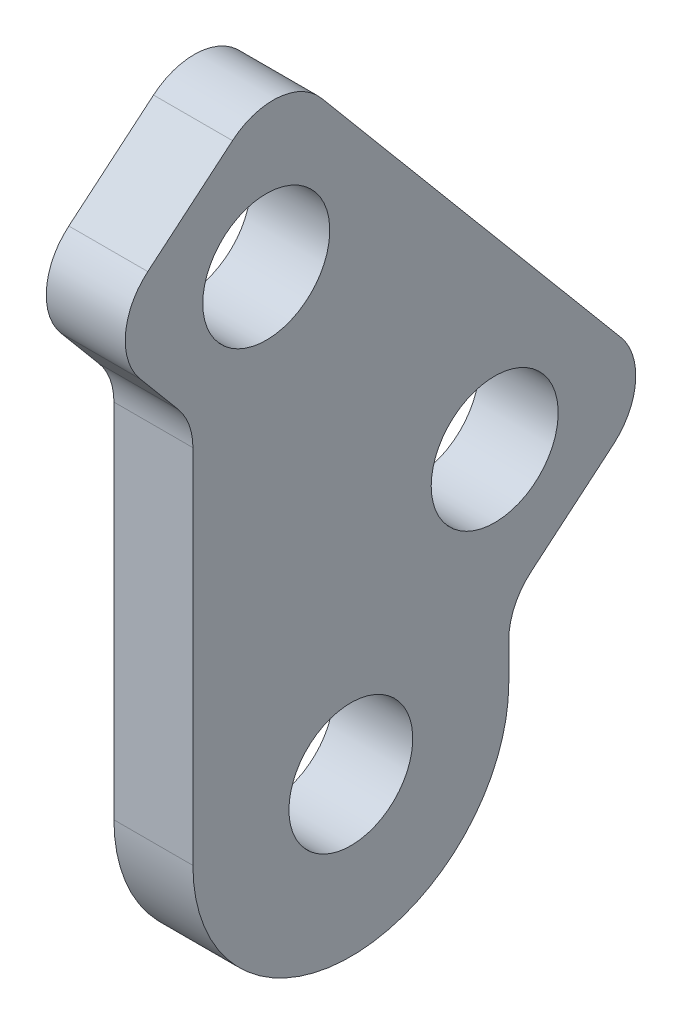
ISO-10303-21;
HEADER;
FILE_DESCRIPTION(('STEP AP214'),'2;1');
FILE_NAME('part.step','',(''),(''),'','','');
FILE_SCHEMA(('AUTOMOTIVE_DESIGN { 1 0 10303 214 1 1 1 1 }'));
ENDSEC;
DATA;
#1=APPLICATION_CONTEXT('core data for automotive mechanical design processes');
#2=APPLICATION_PROTOCOL_DEFINITION('international standard','automotive_design',2000,#1);
#3=PRODUCT_CONTEXT('',#1,'mechanical');
#4=PRODUCT('Part','Part','',(#3));
#5=PRODUCT_RELATED_PRODUCT_CATEGORY('part','',(#4));
#6=PRODUCT_DEFINITION_FORMATION('','',#4);
#7=PRODUCT_DEFINITION_CONTEXT('part definition',#1,'design');
#8=PRODUCT_DEFINITION('design','',#6,#7);
#9=PRODUCT_DEFINITION_SHAPE('','',#8);
#10=(LENGTH_UNIT() NAMED_UNIT(*) SI_UNIT(.MILLI.,.METRE.));
#11=(NAMED_UNIT(*) PLANE_ANGLE_UNIT() SI_UNIT($,.RADIAN.));
#12=(NAMED_UNIT(*) SI_UNIT($,.STERADIAN.) SOLID_ANGLE_UNIT());
#13=UNCERTAINTY_MEASURE_WITH_UNIT(LENGTH_MEASURE(1.E-05),#10,'distance_accuracy_value','');
#14=(GEOMETRIC_REPRESENTATION_CONTEXT(3) GLOBAL_UNCERTAINTY_ASSIGNED_CONTEXT((#13)) GLOBAL_UNIT_ASSIGNED_CONTEXT((#10,
#11,#12)) REPRESENTATION_CONTEXT('',''));
#15=CARTESIAN_POINT('',(0.,0.,0.));
#16=DIRECTION('',(0.,0.,1.));
#17=DIRECTION('',(1.,0.,0.));
#18=AXIS2_PLACEMENT_3D('',#15,#16,#17);
#19=CARTESIAN_POINT('',(1.5875,9.52500000000001,-176.47164647412));
#20=DIRECTION('',(-1.,0.,0.));
#21=DIRECTION('',(0.,0.,1.));
#22=AXIS2_PLACEMENT_3D('',#19,#20,#21);
#23=CYLINDRICAL_SURFACE('',#22,6.34999999999999);
#24=CARTESIAN_POINT('',(-1.5875,9.52500000000001,-176.47164647412));
#25=DIRECTION('',(-1.,0.,0.));
#26=DIRECTION('',(0.,0.,1.));
#27=AXIS2_PLACEMENT_3D('',#24,#25,#26);
#28=CIRCLE('',#27,6.34999999999999);
#29=CARTESIAN_POINT('',(-1.5875,9.52500000000001,-182.82164647412));
#30=VERTEX_POINT('',#29);
#31=CARTESIAN_POINT('',(-1.5875,9.52500000000001,-170.12164647412));
#32=VERTEX_POINT('',#31);
#33=EDGE_CURVE('E167',#30,#32,#28,.T.);
#34=ORIENTED_EDGE('',*,*,#33,.F.);
#35=DIRECTION('',(-1.,0.,0.));
#36=VECTOR('',#35,1.);
#37=CARTESIAN_POINT('',(1.5875,9.52500000000001,-182.82164647412));
#38=LINE('',#37,#36);
#39=CARTESIAN_POINT('',(1.5875,9.52500000000001,-182.82164647412));
#40=VERTEX_POINT('',#39);
#41=EDGE_CURVE('E136',#40,#30,#38,.T.);
#42=ORIENTED_EDGE('',*,*,#41,.F.);
#43=CARTESIAN_POINT('',(1.5875,9.52500000000001,-176.47164647412));
#44=DIRECTION('',(-1.,0.,0.));
#45=DIRECTION('',(0.,0.,1.));
#46=AXIS2_PLACEMENT_3D('',#43,#44,#45);
#47=CIRCLE('',#46,6.34999999999999);
#48=CARTESIAN_POINT('',(1.5875,9.52500000000001,-170.12164647412));
#49=VERTEX_POINT('',#48);
#50=EDGE_CURVE('E143',#40,#49,#47,.T.);
#51=ORIENTED_EDGE('',*,*,#50,.T.);
#52=DIRECTION('',(-1.,0.,0.));
#53=VECTOR('',#52,1.);
#54=CARTESIAN_POINT('',(1.5875,9.52500000000001,-170.12164647412));
#55=LINE('',#54,#53);
#56=EDGE_CURVE('E125',#49,#32,#55,.T.);
#57=ORIENTED_EDGE('',*,*,#56,.T.);
#58=EDGE_LOOP('',(#34,#42,#51,#57));
#59=FACE_BOUND('',#58,.T.);
#60=ADVANCED_FACE('F37',(#59),#23,.T.);
#61=CARTESIAN_POINT('',(1.5875,82.55,-182.82164647412));
#62=DIRECTION('',(0.,0.,-1.));
#63=DIRECTION('',(-1.,0.,0.));
#64=AXIS2_PLACEMENT_3D('',#61,#62,#63);
#65=PLANE('',#64);
#66=DIRECTION('',(0.,-1.,0.));
#67=VECTOR('',#66,1.);
#68=CARTESIAN_POINT('',(-1.5875,82.55,-182.82164647412));
#69=LINE('',#68,#67);
#70=CARTESIAN_POINT('',(-1.5875,11.0180825675104,-182.82164647412));
#71=VERTEX_POINT('',#70);
#72=EDGE_CURVE('E148',#71,#30,#69,.T.);
#73=ORIENTED_EDGE('',*,*,#72,.F.);
#74=DIRECTION('',(-1.,0.,0.));
#75=VECTOR('',#74,1.);
#76=CARTESIAN_POINT('',(1.5875,11.0180825675104,-182.82164647412));
#77=LINE('',#76,#75);
#78=CARTESIAN_POINT('',(1.5875,11.0180825675104,-182.82164647412));
#79=VERTEX_POINT('',#78);
#80=EDGE_CURVE('E204',#71,#79,#77,.F.);
#81=ORIENTED_EDGE('',*,*,#80,.T.);
#82=DIRECTION('',(0.,-1.,0.));
#83=VECTOR('',#82,1.);
#84=CARTESIAN_POINT('',(1.5875,82.55,-182.82164647412));
#85=LINE('',#84,#83);
#86=EDGE_CURVE('E137',#79,#40,#85,.T.);
#87=ORIENTED_EDGE('',*,*,#86,.T.);
#88=ORIENTED_EDGE('',*,*,#41,.T.);
#89=EDGE_LOOP('',(#73,#81,#87,#88));
#90=FACE_BOUND('',#89,.T.);
#91=ADVANCED_FACE('F243',(#90),#65,.T.);
#92=CARTESIAN_POINT('',(1.5875,12.2182173446487,-182.840372886147));
#93=DIRECTION('',(0.,-0.766044443118973,-0.642787609686545));
#94=DIRECTION('',(0.,0.642787609686545,-0.766044443118973));
#95=AXIS2_PLACEMENT_3D('',#92,#93,#94);
#96=PLANE('',#95);
#97=DIRECTION('',(0.,-0.642787609686545,0.766044443118973));
#98=VECTOR('',#97,1.);
#99=CARTESIAN_POINT('',(-1.5875,12.2182173446487,-182.840372886147));
#100=LINE('',#99,#98);
#101=CARTESIAN_POINT('',(-1.5875,15.7246917514835,-187.019226357832));
#102=VERTEX_POINT('',#101);
#103=CARTESIAN_POINT('',(-1.5875,12.9638354530325,-183.728965945517));
#104=VERTEX_POINT('',#103);
#105=EDGE_CURVE('E150',#102,#104,#100,.T.);
#106=ORIENTED_EDGE('',*,*,#105,.F.);
#107=DIRECTION('',(-1.,0.,0.));
#108=VECTOR('',#107,1.);
#109=CARTESIAN_POINT('',(1.5875,15.7246917514835,-187.019226357832));
#110=LINE('',#109,#108);
#111=CARTESIAN_POINT('',(1.5875,15.7246917514835,-187.019226357832));
#112=VERTEX_POINT('',#111);
#113=EDGE_CURVE('E197',#102,#112,#110,.F.);
#114=ORIENTED_EDGE('',*,*,#113,.T.);
#115=DIRECTION('',(0.,-0.642787609686545,0.766044443118973));
#116=VECTOR('',#115,1.);
#117=CARTESIAN_POINT('',(1.5875,12.2182173446487,-182.840372886147));
#118=LINE('',#117,#116);
#119=CARTESIAN_POINT('',(1.5875,12.9638354530325,-183.728965945517));
#120=VERTEX_POINT('',#119);
#121=EDGE_CURVE('E163',#112,#120,#118,.T.);
#122=ORIENTED_EDGE('',*,*,#121,.T.);
#123=DIRECTION('',(-1.,0.,0.));
#124=VECTOR('',#123,1.);
#125=CARTESIAN_POINT('',(-1.5875,12.9638354530325,-183.728965945517));
#126=LINE('',#125,#124);
#127=EDGE_CURVE('E194',#120,#104,#126,.T.);
#128=ORIENTED_EDGE('',*,*,#127,.T.);
#129=EDGE_LOOP('',(#106,#114,#122,#128));
#130=FACE_BOUND('',#129,.T.);
#131=ADVANCED_FACE('F248',(#130),#96,.T.);
#132=CARTESIAN_POINT('',(1.5875,87.6891549354387,-129.949606357207));
#133=DIRECTION('',(0.,0.642787609686544,-0.766044443118974));
#134=DIRECTION('',(0.,0.766044443118974,0.642787609686544));
#135=AXIS2_PLACEMENT_3D('',#132,#133,#134);
#136=PLANE('',#135);
#137=DIRECTION('',(0.,-0.766044443118974,-0.642787609686544));
#138=VECTOR('',#137,1.);
#139=CARTESIAN_POINT('',(1.5875,87.6891549354387,-129.949606357207));
#140=LINE('',#139,#138);
#141=CARTESIAN_POINT('',(1.5875,33.6530526963356,-175.291279816297));
#142=VERTEX_POINT('',#141);
#143=CARTESIAN_POINT('',(1.5875,19.3031251656094,-187.33229871475));
#144=VERTEX_POINT('',#143);
#145=EDGE_CURVE('E160',#142,#144,#140,.T.);
#146=ORIENTED_EDGE('',*,*,#145,.T.);
#147=DIRECTION('',(-1.,0.,0.));
#148=VECTOR('',#147,1.);
#149=CARTESIAN_POINT('',(1.5875,19.3031251656095,-187.33229871475));
#150=LINE('',#149,#148);
#151=CARTESIAN_POINT('',(-1.5875,19.3031251656094,-187.33229871475));
#152=VERTEX_POINT('',#151);
#153=EDGE_CURVE('E185',#144,#152,#150,.T.);
#154=ORIENTED_EDGE('',*,*,#153,.T.);
#155=DIRECTION('',(0.,-0.766044443118974,-0.642787609686544));
#156=VECTOR('',#155,1.);
#157=CARTESIAN_POINT('',(-1.5875,87.6891549354387,-129.949606357207));
#158=LINE('',#157,#156);
#159=CARTESIAN_POINT('',(-1.5875,33.6530526963356,-175.291279816297));
#160=VERTEX_POINT('',#159);
#161=EDGE_CURVE('E177',#160,#152,#158,.T.);
#162=ORIENTED_EDGE('',*,*,#161,.F.);
#163=DIRECTION('',(-1.,0.,0.));
#164=VECTOR('',#163,1.);
#165=CARTESIAN_POINT('',(1.5875,33.6530526963356,-175.291279816297));
#166=LINE('',#165,#164);
#167=EDGE_CURVE('E182',#160,#142,#166,.F.);
#168=ORIENTED_EDGE('',*,*,#167,.T.);
#169=EDGE_LOOP('',(#146,#154,#162,#168));
#170=FACE_BOUND('',#169,.T.);
#171=ADVANCED_FACE('F269',(#170),#136,.T.);
#172=CARTESIAN_POINT('',(1.5875,30.4596506464192,-167.533992930486));
#173=DIRECTION('',(0.,0.766044443118973,0.642787609686545));
#174=DIRECTION('',(0.,-0.642787609686545,0.766044443118973));
#175=AXIS2_PLACEMENT_3D('',#172,#173,#174);
#176=PLANE('',#175);
#177=DIRECTION('',(0.,0.642787609686545,-0.766044443118973));
#178=VECTOR('',#177,1.);
#179=CARTESIAN_POINT('',(-1.5875,30.4596506464192,-167.533992930486));
#180=LINE('',#179,#178);
#181=CARTESIAN_POINT('',(-1.5875,31.1089341281973,-168.307778852507));
#182=VERTEX_POINT('',#181);
#183=CARTESIAN_POINT('',(-1.5875,33.966125053254,-171.712846402171));
#184=VERTEX_POINT('',#183);
#185=EDGE_CURVE('E174',#182,#184,#180,.T.);
#186=ORIENTED_EDGE('',*,*,#185,.F.);
#187=DIRECTION('',(-1.,0.,0.));
#188=VECTOR('',#187,1.);
#189=CARTESIAN_POINT('',(1.5875,31.1089341281973,-168.307778852507));
#190=LINE('',#189,#188);
#191=CARTESIAN_POINT('',(1.5875,31.1089341281973,-168.307778852507));
#192=VERTEX_POINT('',#191);
#193=EDGE_CURVE('E216',#182,#192,#190,.F.);
#194=ORIENTED_EDGE('',*,*,#193,.T.);
#195=DIRECTION('',(0.,0.642787609686545,-0.766044443118973));
#196=VECTOR('',#195,1.);
#197=CARTESIAN_POINT('',(1.5875,30.4596506464192,-167.533992930486));
#198=LINE('',#197,#196);
#199=CARTESIAN_POINT('',(1.5875,33.966125053254,-171.712846402171));
#200=VERTEX_POINT('',#199);
#201=EDGE_CURVE('E157',#192,#200,#198,.T.);
#202=ORIENTED_EDGE('',*,*,#201,.T.);
#203=DIRECTION('',(-1.,0.,0.));
#204=VECTOR('',#203,1.);
#205=CARTESIAN_POINT('',(1.5875,33.966125053254,-171.712846402171));
#206=LINE('',#205,#204);
#207=EDGE_CURVE('E213',#200,#184,#206,.T.);
#208=ORIENTED_EDGE('',*,*,#207,.T.);
#209=EDGE_LOOP('',(#186,#194,#202,#208));
#210=FACE_BOUND('',#209,.T.);
#211=ADVANCED_FACE('F276',(#210),#176,.T.);
#212=CARTESIAN_POINT('',(1.5875,81.5666029531744,-122.653033036499));
#213=DIRECTION('',(0.,-0.642787609686544,0.766044443118974));
#214=DIRECTION('',(0.,-0.766044443118975,-0.642787609686544));
#215=AXIS2_PLACEMENT_3D('',#212,#213,#214);
#216=PLANE('',#215);
#217=DIRECTION('',(0.,0.766044443118974,0.642787609686544));
#218=VECTOR('',#217,1.);
#219=CARTESIAN_POINT('',(-1.5875,81.5666029531744,-122.653033036499));
#220=LINE('',#219,#218);
#221=CARTESIAN_POINT('',(-1.5875,25.7039084869915,-169.527399359643));
#222=VERTEX_POINT('',#221);
#223=CARTESIAN_POINT('',(-1.5875,27.5305007140713,-167.994706495589));
#224=VERTEX_POINT('',#223);
#225=EDGE_CURVE('E171',#222,#224,#220,.T.);
#226=ORIENTED_EDGE('',*,*,#225,.F.);
#227=DIRECTION('',(-1.,0.,0.));
#228=VECTOR('',#227,1.);
#229=CARTESIAN_POINT('',(1.5875,25.7039084869915,-169.527399359643));
#230=LINE('',#229,#228);
#231=CARTESIAN_POINT('',(1.5875,25.7039084869915,-169.527399359643));
#232=VERTEX_POINT('',#231);
#233=EDGE_CURVE('E211',#222,#232,#230,.F.);
#234=ORIENTED_EDGE('',*,*,#233,.T.);
#235=DIRECTION('',(0.,0.766044443118974,0.642787609686544));
#236=VECTOR('',#235,1.);
#237=CARTESIAN_POINT('',(1.5875,81.5666029531744,-122.653033036499));
#238=LINE('',#237,#236);
#239=CARTESIAN_POINT('',(1.5875,27.5305007140713,-167.994706495589));
#240=VERTEX_POINT('',#239);
#241=EDGE_CURVE('E144',#232,#240,#238,.T.);
#242=ORIENTED_EDGE('',*,*,#241,.T.);
#243=DIRECTION('',(-1.,0.,0.));
#244=VECTOR('',#243,1.);
#245=CARTESIAN_POINT('',(1.5875,27.5305007140713,-167.994706495589));
#246=LINE('',#245,#244);
#247=EDGE_CURVE('E208',#240,#224,#246,.T.);
#248=ORIENTED_EDGE('',*,*,#247,.T.);
#249=EDGE_LOOP('',(#226,#234,#242,#248));
#250=FACE_BOUND('',#249,.T.);
#251=ADVANCED_FACE('F227',(#250),#216,.T.);
#252=CARTESIAN_POINT('',(1.5875,82.55,-170.12164647412));
#253=DIRECTION('',(0.,0.,1.));
#254=DIRECTION('',(1.,0.,0.));
#255=AXIS2_PLACEMENT_3D('',#252,#253,#254);
#256=PLANE('',#255);
#257=DIRECTION('',(0.,1.,0.));
#258=VECTOR('',#257,1.);
#259=CARTESIAN_POINT('',(1.5875,82.55,-170.12164647412));
#260=LINE('',#259,#258);
#261=CARTESIAN_POINT('',(1.5875,24.0712279583877,-170.12164647412));
#262=VERTEX_POINT('',#261);
#263=EDGE_CURVE('E128',#49,#262,#260,.T.);
#264=ORIENTED_EDGE('',*,*,#263,.T.);
#265=DIRECTION('',(-1.,0.,0.));
#266=VECTOR('',#265,1.);
#267=CARTESIAN_POINT('',(-1.5875,24.0712279583877,-170.12164647412));
#268=LINE('',#267,#266);
#269=CARTESIAN_POINT('',(-1.5875,24.0712279583877,-170.12164647412));
#270=VERTEX_POINT('',#269);
#271=EDGE_CURVE('E206',#262,#270,#268,.T.);
#272=ORIENTED_EDGE('',*,*,#271,.T.);
#273=DIRECTION('',(0.,1.,0.));
#274=VECTOR('',#273,1.);
#275=CARTESIAN_POINT('',(-1.5875,82.55,-170.12164647412));
#276=LINE('',#275,#274);
#277=EDGE_CURVE('E131',#32,#270,#276,.T.);
#278=ORIENTED_EDGE('',*,*,#277,.F.);
#279=ORIENTED_EDGE('',*,*,#56,.F.);
#280=EDGE_LOOP('',(#264,#272,#278,#279));
#281=FACE_BOUND('',#280,.T.);
#282=ADVANCED_FACE('F126',(#281),#256,.T.);
#283=CARTESIAN_POINT('',(1.5875,9.52500000000001,-176.47164647412));
#284=DIRECTION('',(-1.,0.,0.));
#285=DIRECTION('',(0.,0.,1.));
#286=AXIS2_PLACEMENT_3D('',#283,#284,#285);
#287=PLANE('',#286);
#288=CARTESIAN_POINT('',(1.5875,17.9443829493092,-182.255416591868));
#289=DIRECTION('',(-1.,0.,0.));
#290=DIRECTION('',(0.,0.,1.));
#291=AXIS2_PLACEMENT_3D('',#288,#289,#290);
#292=CIRCLE('',#291,2.55270000000004);
#293=CARTESIAN_POINT('',(1.5875,17.9443829493092,-179.702716591868));
#294=VERTEX_POINT('',#293);
#295=EDGE_CURVE('E325',#294,#294,#292,.T.);
#296=ORIENTED_EDGE('',*,*,#295,.T.);
#297=EDGE_LOOP('',(#296));
#298=FACE_BOUND('',#297,.T.);
#299=CARTESIAN_POINT('',(1.5875,28.8892429303716,-173.071588618471));
#300=DIRECTION('',(-1.,0.,0.));
#301=DIRECTION('',(0.,0.,1.));
#302=AXIS2_PLACEMENT_3D('',#299,#300,#301);
#303=CIRCLE('',#302,2.55269999999998);
#304=CARTESIAN_POINT('',(1.5875,28.8892429303716,-170.518888618471));
#305=VERTEX_POINT('',#304);
#306=EDGE_CURVE('E320',#305,#305,#303,.T.);
#307=ORIENTED_EDGE('',*,*,#306,.T.);
#308=EDGE_LOOP('',(#307));
#309=FACE_BOUND('',#308,.T.);
#310=CARTESIAN_POINT('',(1.5875,9.52500000000001,-176.47164647412));
#311=DIRECTION('',(-1.,0.,0.));
#312=DIRECTION('',(0.,0.,1.));
#313=AXIS2_PLACEMENT_3D('',#310,#311,#312);
#314=CIRCLE('',#313,2.4892);
#315=CARTESIAN_POINT('',(1.5875,9.52500000000001,-173.98244647412));
#316=VERTEX_POINT('',#315);
#317=EDGE_CURVE('E169',#316,#316,#314,.T.);
#318=ORIENTED_EDGE('',*,*,#317,.T.);
#319=EDGE_LOOP('',(#318));
#320=FACE_BOUND('',#319,.T.);
#321=ORIENTED_EDGE('',*,*,#121,.F.);
#322=CARTESIAN_POINT('',(1.5875,17.6704446370056,-185.386545829228));
#323=DIRECTION('',(-1.,0.,0.));
#324=DIRECTION('',(0.,0.,1.));
#325=AXIS2_PLACEMENT_3D('',#322,#323,#324);
#326=CIRCLE('',#325,2.54);
#327=EDGE_CURVE('E202',#112,#144,#326,.F.);
#328=ORIENTED_EDGE('',*,*,#327,.T.);
#329=ORIENTED_EDGE('',*,*,#145,.F.);
#330=CARTESIAN_POINT('',(1.5875,32.0203721677318,-173.345526930775));
#331=DIRECTION('',(-1.,0.,0.));
#332=DIRECTION('',(0.,0.,1.));
#333=AXIS2_PLACEMENT_3D('',#330,#331,#332);
#334=CIRCLE('',#333,2.54);
#335=EDGE_CURVE('E199',#142,#200,#334,.F.);
#336=ORIENTED_EDGE('',*,*,#335,.T.);
#337=ORIENTED_EDGE('',*,*,#201,.F.);
#338=CARTESIAN_POINT('',(1.5875,29.1631812426751,-169.940459381111));
#339=DIRECTION('',(-1.,0.,0.));
#340=DIRECTION('',(0.,0.,1.));
#341=AXIS2_PLACEMENT_3D('',#338,#339,#340);
#342=CIRCLE('',#341,2.54);
#343=EDGE_CURVE('E56',#192,#240,#342,.F.);
#344=ORIENTED_EDGE('',*,*,#343,.T.);
#345=ORIENTED_EDGE('',*,*,#241,.F.);
#346=CARTESIAN_POINT('',(1.5875,24.0712279583877,-167.58164647412));
#347=DIRECTION('',(-1.,0.,0.));
#348=DIRECTION('',(0.,0.,1.));
#349=AXIS2_PLACEMENT_3D('',#346,#347,#348);
#350=CIRCLE('',#349,2.54);
#351=EDGE_CURVE('E11',#232,#262,#350,.T.);
#352=ORIENTED_EDGE('',*,*,#351,.T.);
#353=ORIENTED_EDGE('',*,*,#263,.F.);
#354=ORIENTED_EDGE('',*,*,#50,.F.);
#355=ORIENTED_EDGE('',*,*,#86,.F.);
#356=CARTESIAN_POINT('',(1.5875,11.0180825675104,-185.36164647412));
#357=DIRECTION('',(-1.,0.,0.));
#358=DIRECTION('',(0.,0.,1.));
#359=AXIS2_PLACEMENT_3D('',#356,#357,#358);
#360=CIRCLE('',#359,2.54);
#361=EDGE_CURVE('E220',#79,#120,#360,.T.);
#362=ORIENTED_EDGE('',*,*,#361,.T.);
#363=EDGE_LOOP('',(#321,#328,#329,#336,#337,#344,#345,#352,#353,#354,#355,#362));
#364=FACE_BOUND('',#363,.T.);
#365=ADVANCED_FACE('F141',(#298,#309,#320,#364),#287,.F.);
#366=CARTESIAN_POINT('',(-1.5875,9.52500000000001,-176.47164647412));
#367=DIRECTION('',(-1.,0.,0.));
#368=DIRECTION('',(0.,0.,1.));
#369=AXIS2_PLACEMENT_3D('',#366,#367,#368);
#370=PLANE('',#369);
#371=CARTESIAN_POINT('',(-1.5875,17.9443829493092,-182.255416591868));
#372=DIRECTION('',(-1.,0.,0.));
#373=DIRECTION('',(0.,0.,1.));
#374=AXIS2_PLACEMENT_3D('',#371,#372,#373);
#375=CIRCLE('',#374,2.55270000000004);
#376=CARTESIAN_POINT('',(-1.5875,17.9443829493092,-179.702716591868));
#377=VERTEX_POINT('',#376);
#378=EDGE_CURVE('E328',#377,#377,#375,.T.);
#379=ORIENTED_EDGE('',*,*,#378,.F.);
#380=EDGE_LOOP('',(#379));
#381=FACE_BOUND('',#380,.T.);
#382=CARTESIAN_POINT('',(-1.5875,28.8892429303716,-173.071588618471));
#383=DIRECTION('',(-1.,0.,0.));
#384=DIRECTION('',(0.,0.,1.));
#385=AXIS2_PLACEMENT_3D('',#382,#383,#384);
#386=CIRCLE('',#385,2.55269999999998);
#387=CARTESIAN_POINT('',(-1.5875,28.8892429303716,-170.518888618471));
#388=VERTEX_POINT('',#387);
#389=EDGE_CURVE('E323',#388,#388,#386,.T.);
#390=ORIENTED_EDGE('',*,*,#389,.F.);
#391=EDGE_LOOP('',(#390));
#392=FACE_BOUND('',#391,.T.);
#393=CARTESIAN_POINT('',(-1.5875,9.52500000000001,-176.47164647412));
#394=DIRECTION('',(-1.,0.,0.));
#395=DIRECTION('',(0.,0.,1.));
#396=AXIS2_PLACEMENT_3D('',#393,#394,#395);
#397=CIRCLE('',#396,2.4892);
#398=CARTESIAN_POINT('',(-1.5875,9.52500000000001,-173.98244647412));
#399=VERTEX_POINT('',#398);
#400=EDGE_CURVE('E153',#399,#399,#397,.T.);
#401=ORIENTED_EDGE('',*,*,#400,.F.);
#402=EDGE_LOOP('',(#401));
#403=FACE_BOUND('',#402,.T.);
#404=ORIENTED_EDGE('',*,*,#161,.T.);
#405=CARTESIAN_POINT('',(-1.5875,17.6704446370056,-185.386545829228));
#406=DIRECTION('',(-1.,0.,0.));
#407=DIRECTION('',(0.,0.,1.));
#408=AXIS2_PLACEMENT_3D('',#405,#406,#407);
#409=CIRCLE('',#408,2.54);
#410=EDGE_CURVE('E192',#152,#102,#409,.T.);
#411=ORIENTED_EDGE('',*,*,#410,.T.);
#412=ORIENTED_EDGE('',*,*,#105,.T.);
#413=CARTESIAN_POINT('',(-1.5875,11.0180825675104,-185.36164647412));
#414=DIRECTION('',(-1.,0.,0.));
#415=DIRECTION('',(0.,0.,1.));
#416=AXIS2_PLACEMENT_3D('',#413,#414,#415);
#417=CIRCLE('',#416,2.54);
#418=EDGE_CURVE('E218',#104,#71,#417,.F.);
#419=ORIENTED_EDGE('',*,*,#418,.T.);
#420=ORIENTED_EDGE('',*,*,#72,.T.);
#421=ORIENTED_EDGE('',*,*,#33,.T.);
#422=ORIENTED_EDGE('',*,*,#277,.T.);
#423=CARTESIAN_POINT('',(-1.5875,24.0712279583877,-167.58164647412));
#424=DIRECTION('',(-1.,0.,0.));
#425=DIRECTION('',(0.,0.,1.));
#426=AXIS2_PLACEMENT_3D('',#423,#424,#425);
#427=CIRCLE('',#426,2.54);
#428=EDGE_CURVE('E45',#270,#222,#427,.F.);
#429=ORIENTED_EDGE('',*,*,#428,.T.);
#430=ORIENTED_EDGE('',*,*,#225,.T.);
#431=CARTESIAN_POINT('',(-1.5875,29.1631812426751,-169.940459381111));
#432=DIRECTION('',(-1.,0.,0.));
#433=DIRECTION('',(0.,0.,1.));
#434=AXIS2_PLACEMENT_3D('',#431,#432,#433);
#435=CIRCLE('',#434,2.54);
#436=EDGE_CURVE('E190',#224,#182,#435,.T.);
#437=ORIENTED_EDGE('',*,*,#436,.T.);
#438=ORIENTED_EDGE('',*,*,#185,.T.);
#439=CARTESIAN_POINT('',(-1.5875,32.0203721677318,-173.345526930775));
#440=DIRECTION('',(-1.,0.,0.));
#441=DIRECTION('',(0.,0.,1.));
#442=AXIS2_PLACEMENT_3D('',#439,#440,#441);
#443=CIRCLE('',#442,2.54);
#444=EDGE_CURVE('E188',#184,#160,#443,.T.);
#445=ORIENTED_EDGE('',*,*,#444,.T.);
#446=EDGE_LOOP('',(#404,#411,#412,#419,#420,#421,#422,#429,#430,#437,#438,#445));
#447=FACE_BOUND('',#446,.T.);
#448=ADVANCED_FACE('F223',(#381,#392,#403,#447),#370,.T.);
#449=CARTESIAN_POINT('',(1.5875,9.52500000000001,-176.47164647412));
#450=DIRECTION('',(-1.,0.,0.));
#451=DIRECTION('',(0.,0.,1.));
#452=AXIS2_PLACEMENT_3D('',#449,#450,#451);
#453=CYLINDRICAL_SURFACE('',#452,2.4892);
#454=ORIENTED_EDGE('',*,*,#317,.F.);
#455=EDGE_LOOP('',(#454));
#456=FACE_BOUND('',#455,.T.);
#457=ORIENTED_EDGE('',*,*,#400,.T.);
#458=EDGE_LOOP('',(#457));
#459=FACE_BOUND('',#458,.T.);
#460=ADVANCED_FACE('F305',(#456,#459),#453,.F.);
#461=CARTESIAN_POINT('',(1.5875,28.8892429303716,-173.071588618471));
#462=DIRECTION('',(-1.,0.,0.));
#463=DIRECTION('',(0.,0.,1.));
#464=AXIS2_PLACEMENT_3D('',#461,#462,#463);
#465=CYLINDRICAL_SURFACE('',#464,2.55269999999998);
#466=ORIENTED_EDGE('',*,*,#306,.F.);
#467=EDGE_LOOP('',(#466));
#468=FACE_BOUND('',#467,.T.);
#469=ORIENTED_EDGE('',*,*,#389,.T.);
#470=EDGE_LOOP('',(#469));
#471=FACE_BOUND('',#470,.T.);
#472=ADVANCED_FACE('F260',(#468,#471),#465,.F.);
#473=CARTESIAN_POINT('',(1.5875,17.9443829493092,-182.255416591868));
#474=DIRECTION('',(-1.,0.,0.));
#475=DIRECTION('',(0.,0.,1.));
#476=AXIS2_PLACEMENT_3D('',#473,#474,#475);
#477=CYLINDRICAL_SURFACE('',#476,2.55270000000004);
#478=ORIENTED_EDGE('',*,*,#295,.F.);
#479=EDGE_LOOP('',(#478));
#480=FACE_BOUND('',#479,.T.);
#481=ORIENTED_EDGE('',*,*,#378,.T.);
#482=EDGE_LOOP('',(#481));
#483=FACE_BOUND('',#482,.T.);
#484=ADVANCED_FACE('F255',(#480,#483),#477,.F.);
#485=CARTESIAN_POINT('',(1.5875,17.6704446370056,-185.386545829228));
#486=DIRECTION('',(-1.,0.,0.));
#487=DIRECTION('',(0.,0.,1.));
#488=AXIS2_PLACEMENT_3D('',#485,#486,#487);
#489=CYLINDRICAL_SURFACE('',#488,2.54);
#490=ORIENTED_EDGE('',*,*,#327,.F.);
#491=ORIENTED_EDGE('',*,*,#113,.F.);
#492=ORIENTED_EDGE('',*,*,#410,.F.);
#493=ORIENTED_EDGE('',*,*,#153,.F.);
#494=EDGE_LOOP('',(#490,#491,#492,#493));
#495=FACE_BOUND('',#494,.T.);
#496=ADVANCED_FACE('F239',(#495),#489,.T.);
#497=CARTESIAN_POINT('',(1.5875,11.0180825675104,-185.36164647412));
#498=DIRECTION('',(1.,0.,0.));
#499=DIRECTION('',(0.,0.,-1.));
#500=AXIS2_PLACEMENT_3D('',#497,#498,#499);
#501=CYLINDRICAL_SURFACE('',#500,2.54);
#502=ORIENTED_EDGE('',*,*,#361,.F.);
#503=ORIENTED_EDGE('',*,*,#80,.F.);
#504=ORIENTED_EDGE('',*,*,#418,.F.);
#505=ORIENTED_EDGE('',*,*,#127,.F.);
#506=EDGE_LOOP('',(#502,#503,#504,#505));
#507=FACE_BOUND('',#506,.T.);
#508=ADVANCED_FACE('F232',(#507),#501,.F.);
#509=CARTESIAN_POINT('',(1.5875,24.0712279583877,-167.58164647412));
#510=DIRECTION('',(1.,0.,0.));
#511=DIRECTION('',(0.,0.,-1.));
#512=AXIS2_PLACEMENT_3D('',#509,#510,#511);
#513=CYLINDRICAL_SURFACE('',#512,2.54);
#514=ORIENTED_EDGE('',*,*,#351,.F.);
#515=ORIENTED_EDGE('',*,*,#233,.F.);
#516=ORIENTED_EDGE('',*,*,#428,.F.);
#517=ORIENTED_EDGE('',*,*,#271,.F.);
#518=EDGE_LOOP('',(#514,#515,#516,#517));
#519=FACE_BOUND('',#518,.T.);
#520=ADVANCED_FACE('F229',(#519),#513,.F.);
#521=CARTESIAN_POINT('',(1.5875,29.1631812426751,-169.940459381111));
#522=DIRECTION('',(-1.,0.,0.));
#523=DIRECTION('',(0.,0.,1.));
#524=AXIS2_PLACEMENT_3D('',#521,#522,#523);
#525=CYLINDRICAL_SURFACE('',#524,2.54);
#526=ORIENTED_EDGE('',*,*,#343,.F.);
#527=ORIENTED_EDGE('',*,*,#193,.F.);
#528=ORIENTED_EDGE('',*,*,#436,.F.);
#529=ORIENTED_EDGE('',*,*,#247,.F.);
#530=EDGE_LOOP('',(#526,#527,#528,#529));
#531=FACE_BOUND('',#530,.T.);
#532=ADVANCED_FACE('F231',(#531),#525,.T.);
#533=CARTESIAN_POINT('',(1.5875,32.0203721677318,-173.345526930775));
#534=DIRECTION('',(-1.,0.,0.));
#535=DIRECTION('',(0.,0.,1.));
#536=AXIS2_PLACEMENT_3D('',#533,#534,#535);
#537=CYLINDRICAL_SURFACE('',#536,2.54);
#538=ORIENTED_EDGE('',*,*,#335,.F.);
#539=ORIENTED_EDGE('',*,*,#167,.F.);
#540=ORIENTED_EDGE('',*,*,#444,.F.);
#541=ORIENTED_EDGE('',*,*,#207,.F.);
#542=EDGE_LOOP('',(#538,#539,#540,#541));
#543=FACE_BOUND('',#542,.T.);
#544=ADVANCED_FACE('F39',(#543),#537,.T.);
#545=CLOSED_SHELL('',(#60,#91,#131,#171,#211,#251,#282,#365,#448,#460,#472,#484,#496,#508,#520,
#532,#544));
#546=MANIFOLD_SOLID_BREP('B2',#545);
#547=ADVANCED_BREP_SHAPE_REPRESENTATION('',(#18,#546),#14);
#548=SHAPE_DEFINITION_REPRESENTATION(#9,#547);
ENDSEC;
END-ISO-10303-21;
